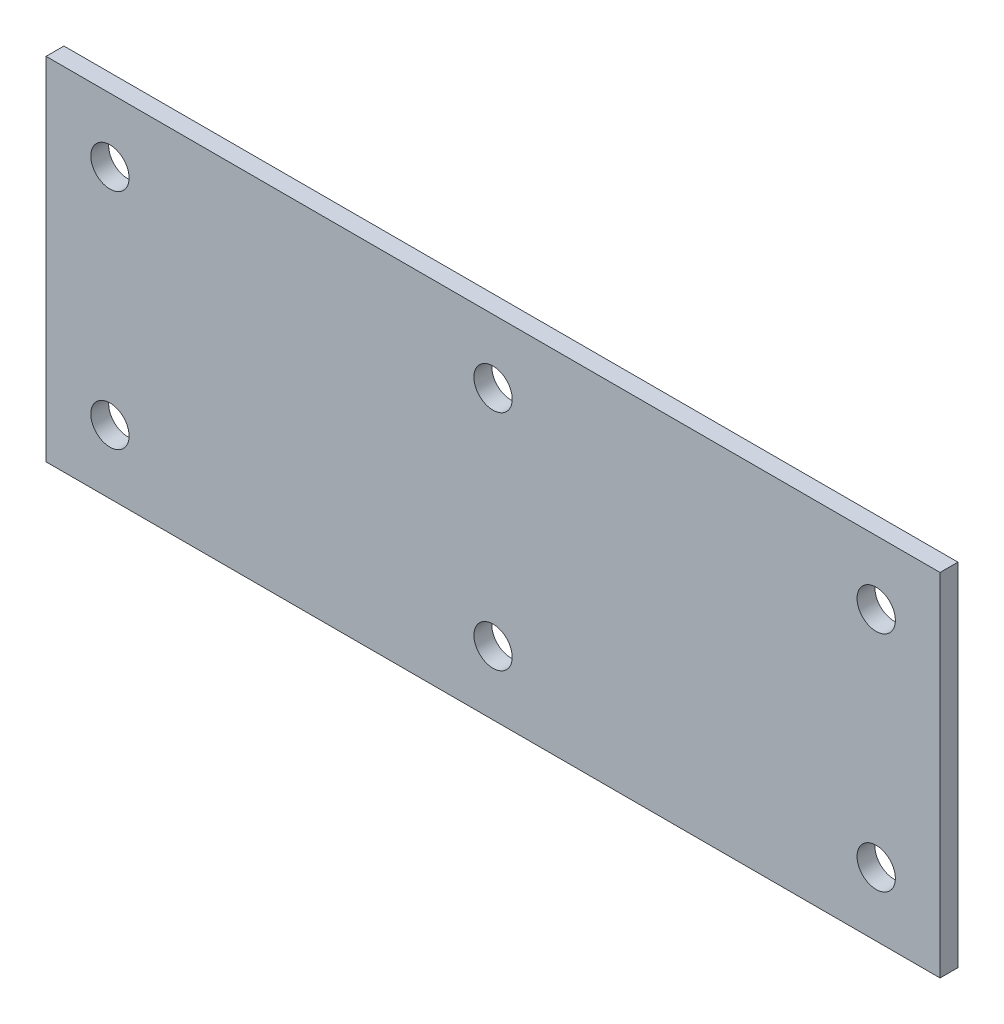
ISO-10303-21;
HEADER;
FILE_DESCRIPTION(('STEP AP214'),'2;1');
FILE_NAME('part.step','',(''),(''),'','','');
FILE_SCHEMA(('AUTOMOTIVE_DESIGN { 1 0 10303 214 1 1 1 1 }'));
ENDSEC;
DATA;
#1=APPLICATION_CONTEXT('core data for automotive mechanical design processes');
#2=APPLICATION_PROTOCOL_DEFINITION('international standard','automotive_design',2000,#1);
#3=PRODUCT_CONTEXT('',#1,'mechanical');
#4=PRODUCT('Part','Part','',(#3));
#5=PRODUCT_RELATED_PRODUCT_CATEGORY('part','',(#4));
#6=PRODUCT_DEFINITION_FORMATION('','',#4);
#7=PRODUCT_DEFINITION_CONTEXT('part definition',#1,'design');
#8=PRODUCT_DEFINITION('design','',#6,#7);
#9=PRODUCT_DEFINITION_SHAPE('','',#8);
#10=(LENGTH_UNIT() NAMED_UNIT(*) SI_UNIT(.MILLI.,.METRE.));
#11=(NAMED_UNIT(*) PLANE_ANGLE_UNIT() SI_UNIT($,.RADIAN.));
#12=(NAMED_UNIT(*) SI_UNIT($,.STERADIAN.) SOLID_ANGLE_UNIT());
#13=UNCERTAINTY_MEASURE_WITH_UNIT(LENGTH_MEASURE(1.E-05),#10,'distance_accuracy_value','');
#14=(GEOMETRIC_REPRESENTATION_CONTEXT(3) GLOBAL_UNCERTAINTY_ASSIGNED_CONTEXT((#13)) GLOBAL_UNIT_ASSIGNED_CONTEXT((#10,
#11,#12)) REPRESENTATION_CONTEXT('',''));
#15=CARTESIAN_POINT('',(0.,0.,0.));
#16=DIRECTION('',(0.,0.,1.));
#17=DIRECTION('',(1.,0.,0.));
#18=AXIS2_PLACEMENT_3D('',#15,#16,#17);
#19=CARTESIAN_POINT('',(44.45,17.4625,1.778));
#20=DIRECTION('',(-1.,0.,0.));
#21=DIRECTION('',(0.,0.,1.));
#22=AXIS2_PLACEMENT_3D('',#19,#20,#21);
#23=PLANE('',#22);
#24=DIRECTION('',(0.,1.,0.));
#25=VECTOR('',#24,1.);
#26=CARTESIAN_POINT('',(44.45,17.4625,0.));
#27=LINE('',#26,#25);
#28=CARTESIAN_POINT('',(44.45,-17.4625,0.));
#29=VERTEX_POINT('',#28);
#30=CARTESIAN_POINT('',(44.45,17.4625,0.));
#31=VERTEX_POINT('',#30);
#32=EDGE_CURVE('E113',#29,#31,#27,.T.);
#33=ORIENTED_EDGE('',*,*,#32,.T.);
#34=DIRECTION('',(0.,0.,-1.));
#35=VECTOR('',#34,1.);
#36=CARTESIAN_POINT('',(44.45,17.4625,1.778));
#37=LINE('',#36,#35);
#38=CARTESIAN_POINT('',(44.45,17.4625,1.778));
#39=VERTEX_POINT('',#38);
#40=EDGE_CURVE('E11',#39,#31,#37,.T.);
#41=ORIENTED_EDGE('',*,*,#40,.F.);
#42=DIRECTION('',(0.,1.,0.));
#43=VECTOR('',#42,1.);
#44=CARTESIAN_POINT('',(44.45,17.4625,1.778));
#45=LINE('',#44,#43);
#46=CARTESIAN_POINT('',(44.45,-17.4625,1.778));
#47=VERTEX_POINT('',#46);
#48=EDGE_CURVE('E97',#47,#39,#45,.T.);
#49=ORIENTED_EDGE('',*,*,#48,.F.);
#50=DIRECTION('',(0.,0.,-1.));
#51=VECTOR('',#50,1.);
#52=CARTESIAN_POINT('',(44.45,-17.4625,1.778));
#53=LINE('',#52,#51);
#54=EDGE_CURVE('E109',#47,#29,#53,.T.);
#55=ORIENTED_EDGE('',*,*,#54,.T.);
#56=EDGE_LOOP('',(#33,#41,#49,#55));
#57=FACE_BOUND('',#56,.T.);
#58=ADVANCED_FACE('F45',(#57),#23,.F.);
#59=CARTESIAN_POINT('',(-44.45,17.4625,1.778));
#60=DIRECTION('',(0.,-1.,0.));
#61=DIRECTION('',(0.,0.,-1.));
#62=AXIS2_PLACEMENT_3D('',#59,#60,#61);
#63=PLANE('',#62);
#64=DIRECTION('',(-1.,0.,0.));
#65=VECTOR('',#64,1.);
#66=CARTESIAN_POINT('',(-44.45,17.4625,0.));
#67=LINE('',#66,#65);
#68=CARTESIAN_POINT('',(-44.45,17.4625,0.));
#69=VERTEX_POINT('',#68);
#70=EDGE_CURVE('E102',#31,#69,#67,.T.);
#71=ORIENTED_EDGE('',*,*,#70,.T.);
#72=DIRECTION('',(0.,0.,-1.));
#73=VECTOR('',#72,1.);
#74=CARTESIAN_POINT('',(-44.45,17.4625,1.778));
#75=LINE('',#74,#73);
#76=CARTESIAN_POINT('',(-44.45,17.4625,1.778));
#77=VERTEX_POINT('',#76);
#78=EDGE_CURVE('E54',#77,#69,#75,.T.);
#79=ORIENTED_EDGE('',*,*,#78,.F.);
#80=DIRECTION('',(-1.,0.,0.));
#81=VECTOR('',#80,1.);
#82=CARTESIAN_POINT('',(-44.45,17.4625,1.778));
#83=LINE('',#82,#81);
#84=EDGE_CURVE('E92',#39,#77,#83,.T.);
#85=ORIENTED_EDGE('',*,*,#84,.F.);
#86=ORIENTED_EDGE('',*,*,#40,.T.);
#87=EDGE_LOOP('',(#71,#79,#85,#86));
#88=FACE_BOUND('',#87,.T.);
#89=ADVANCED_FACE('F101',(#88),#63,.F.);
#90=CARTESIAN_POINT('',(-44.45,17.4625,1.778));
#91=DIRECTION('',(1.,0.,0.));
#92=DIRECTION('',(0.,0.,-1.));
#93=AXIS2_PLACEMENT_3D('',#90,#91,#92);
#94=PLANE('',#93);
#95=DIRECTION('',(0.,-1.,0.));
#96=VECTOR('',#95,1.);
#97=CARTESIAN_POINT('',(-44.45,17.4625,0.));
#98=LINE('',#97,#96);
#99=CARTESIAN_POINT('',(-44.45,-17.4625,0.));
#100=VERTEX_POINT('',#99);
#101=EDGE_CURVE('E79',#69,#100,#98,.T.);
#102=ORIENTED_EDGE('',*,*,#101,.T.);
#103=DIRECTION('',(0.,0.,-1.));
#104=VECTOR('',#103,1.);
#105=CARTESIAN_POINT('',(-44.45,-17.4625,1.778));
#106=LINE('',#105,#104);
#107=CARTESIAN_POINT('',(-44.45,-17.4625,1.778));
#108=VERTEX_POINT('',#107);
#109=EDGE_CURVE('E104',#108,#100,#106,.T.);
#110=ORIENTED_EDGE('',*,*,#109,.F.);
#111=DIRECTION('',(0.,-1.,0.));
#112=VECTOR('',#111,1.);
#113=CARTESIAN_POINT('',(-44.45,17.4625,1.778));
#114=LINE('',#113,#112);
#115=EDGE_CURVE('E95',#77,#108,#114,.T.);
#116=ORIENTED_EDGE('',*,*,#115,.F.);
#117=ORIENTED_EDGE('',*,*,#78,.T.);
#118=EDGE_LOOP('',(#102,#110,#116,#117));
#119=FACE_BOUND('',#118,.T.);
#120=ADVANCED_FACE('F105',(#119),#94,.F.);
#121=CARTESIAN_POINT('',(-44.45,-17.4625,1.778));
#122=DIRECTION('',(0.,1.,0.));
#123=DIRECTION('',(0.,0.,1.));
#124=AXIS2_PLACEMENT_3D('',#121,#122,#123);
#125=PLANE('',#124);
#126=DIRECTION('',(1.,0.,0.));
#127=VECTOR('',#126,1.);
#128=CARTESIAN_POINT('',(-44.45,-17.4625,0.));
#129=LINE('',#128,#127);
#130=EDGE_CURVE('E85',#100,#29,#129,.T.);
#131=ORIENTED_EDGE('',*,*,#130,.T.);
#132=ORIENTED_EDGE('',*,*,#54,.F.);
#133=DIRECTION('',(1.,0.,0.));
#134=VECTOR('',#133,1.);
#135=CARTESIAN_POINT('',(-44.45,-17.4625,1.778));
#136=LINE('',#135,#134);
#137=EDGE_CURVE('E62',#108,#47,#136,.T.);
#138=ORIENTED_EDGE('',*,*,#137,.F.);
#139=ORIENTED_EDGE('',*,*,#109,.T.);
#140=EDGE_LOOP('',(#131,#132,#138,#139));
#141=FACE_BOUND('',#140,.T.);
#142=ADVANCED_FACE('F127',(#141),#125,.F.);
#143=CARTESIAN_POINT('',(0.,0.,1.778));
#144=DIRECTION('',(0.,0.,1.));
#145=DIRECTION('',(1.,0.,0.));
#146=AXIS2_PLACEMENT_3D('',#143,#144,#145);
#147=PLANE('',#146);
#148=CARTESIAN_POINT('',(-38.1,11.1125,1.778));
#149=DIRECTION('',(0.,0.,1.));
#150=DIRECTION('',(1.,0.,0.));
#151=AXIS2_PLACEMENT_3D('',#148,#149,#150);
#152=CIRCLE('',#151,1.905);
#153=CARTESIAN_POINT('',(-36.195,11.1125,1.778));
#154=VERTEX_POINT('',#153);
#155=EDGE_CURVE('E138',#154,#154,#152,.T.);
#156=ORIENTED_EDGE('',*,*,#155,.F.);
#157=EDGE_LOOP('',(#156));
#158=FACE_BOUND('',#157,.T.);
#159=CARTESIAN_POINT('',(-38.1,-11.1125,1.778));
#160=DIRECTION('',(0.,0.,1.));
#161=DIRECTION('',(-1.,0.,0.));
#162=AXIS2_PLACEMENT_3D('',#159,#160,#161);
#163=CIRCLE('',#162,1.905);
#164=CARTESIAN_POINT('',(-40.005,-11.1125,1.778));
#165=VERTEX_POINT('',#164);
#166=EDGE_CURVE('E163',#165,#165,#163,.T.);
#167=ORIENTED_EDGE('',*,*,#166,.F.);
#168=EDGE_LOOP('',(#167));
#169=FACE_BOUND('',#168,.T.);
#170=CARTESIAN_POINT('',(0.,-11.1125,1.778));
#171=DIRECTION('',(0.,0.,1.));
#172=DIRECTION('',(-1.,0.,0.));
#173=AXIS2_PLACEMENT_3D('',#170,#171,#172);
#174=CIRCLE('',#173,1.905);
#175=CARTESIAN_POINT('',(-1.905,-11.1125,1.778));
#176=VERTEX_POINT('',#175);
#177=EDGE_CURVE('E155',#176,#176,#174,.T.);
#178=ORIENTED_EDGE('',*,*,#177,.F.);
#179=EDGE_LOOP('',(#178));
#180=FACE_BOUND('',#179,.T.);
#181=CARTESIAN_POINT('',(38.1,-11.1125,1.778));
#182=DIRECTION('',(0.,0.,1.));
#183=DIRECTION('',(1.,0.,0.));
#184=AXIS2_PLACEMENT_3D('',#181,#182,#183);
#185=CIRCLE('',#184,1.905);
#186=CARTESIAN_POINT('',(40.005,-11.1125,1.778));
#187=VERTEX_POINT('',#186);
#188=EDGE_CURVE('E146',#187,#187,#185,.T.);
#189=ORIENTED_EDGE('',*,*,#188,.F.);
#190=EDGE_LOOP('',(#189));
#191=FACE_BOUND('',#190,.T.);
#192=CARTESIAN_POINT('',(38.1,11.1125,1.778));
#193=DIRECTION('',(0.,0.,1.));
#194=DIRECTION('',(-1.,0.,0.));
#195=AXIS2_PLACEMENT_3D('',#192,#193,#194);
#196=CIRCLE('',#195,1.905);
#197=CARTESIAN_POINT('',(36.195,11.1125,1.778));
#198=VERTEX_POINT('',#197);
#199=EDGE_CURVE('E147',#198,#198,#196,.T.);
#200=ORIENTED_EDGE('',*,*,#199,.F.);
#201=EDGE_LOOP('',(#200));
#202=FACE_BOUND('',#201,.T.);
#203=CARTESIAN_POINT('',(0.,11.1125,1.778));
#204=DIRECTION('',(0.,0.,1.));
#205=DIRECTION('',(1.,0.,0.));
#206=AXIS2_PLACEMENT_3D('',#203,#204,#205);
#207=CIRCLE('',#206,1.905);
#208=CARTESIAN_POINT('',(1.905,11.1125,1.778));
#209=VERTEX_POINT('',#208);
#210=EDGE_CURVE('E134',#209,#209,#207,.T.);
#211=ORIENTED_EDGE('',*,*,#210,.F.);
#212=EDGE_LOOP('',(#211));
#213=FACE_BOUND('',#212,.T.);
#214=ORIENTED_EDGE('',*,*,#48,.T.);
#215=ORIENTED_EDGE('',*,*,#84,.T.);
#216=ORIENTED_EDGE('',*,*,#115,.T.);
#217=ORIENTED_EDGE('',*,*,#137,.T.);
#218=EDGE_LOOP('',(#214,#215,#216,#217));
#219=FACE_BOUND('',#218,.T.);
#220=ADVANCED_FACE('F93',(#158,#169,#180,#191,#202,#213,#219),#147,.T.);
#221=CARTESIAN_POINT('',(0.,0.,0.));
#222=DIRECTION('',(0.,0.,1.));
#223=DIRECTION('',(1.,0.,0.));
#224=AXIS2_PLACEMENT_3D('',#221,#222,#223);
#225=PLANE('',#224);
#226=CARTESIAN_POINT('',(-38.1,11.1125,0.));
#227=DIRECTION('',(0.,0.,1.));
#228=DIRECTION('',(1.,0.,0.));
#229=AXIS2_PLACEMENT_3D('',#226,#227,#228);
#230=CIRCLE('',#229,1.905);
#231=CARTESIAN_POINT('',(-36.195,11.1125,0.));
#232=VERTEX_POINT('',#231);
#233=EDGE_CURVE('E167',#232,#232,#230,.T.);
#234=ORIENTED_EDGE('',*,*,#233,.T.);
#235=EDGE_LOOP('',(#234));
#236=FACE_BOUND('',#235,.T.);
#237=CARTESIAN_POINT('',(-38.1,-11.1125,0.));
#238=DIRECTION('',(0.,0.,1.));
#239=DIRECTION('',(-1.,0.,0.));
#240=AXIS2_PLACEMENT_3D('',#237,#238,#239);
#241=CIRCLE('',#240,1.905);
#242=CARTESIAN_POINT('',(-40.005,-11.1125,0.));
#243=VERTEX_POINT('',#242);
#244=EDGE_CURVE('E159',#243,#243,#241,.T.);
#245=ORIENTED_EDGE('',*,*,#244,.T.);
#246=EDGE_LOOP('',(#245));
#247=FACE_BOUND('',#246,.T.);
#248=CARTESIAN_POINT('',(0.,-11.1125,0.));
#249=DIRECTION('',(0.,0.,1.));
#250=DIRECTION('',(-1.,0.,0.));
#251=AXIS2_PLACEMENT_3D('',#248,#249,#250);
#252=CIRCLE('',#251,1.905);
#253=CARTESIAN_POINT('',(-1.905,-11.1125,0.));
#254=VERTEX_POINT('',#253);
#255=EDGE_CURVE('E151',#254,#254,#252,.T.);
#256=ORIENTED_EDGE('',*,*,#255,.T.);
#257=EDGE_LOOP('',(#256));
#258=FACE_BOUND('',#257,.T.);
#259=CARTESIAN_POINT('',(38.1,-11.1125,0.));
#260=DIRECTION('',(0.,0.,1.));
#261=DIRECTION('',(1.,0.,0.));
#262=AXIS2_PLACEMENT_3D('',#259,#260,#261);
#263=CIRCLE('',#262,1.905);
#264=CARTESIAN_POINT('',(40.005,-11.1125,0.));
#265=VERTEX_POINT('',#264);
#266=EDGE_CURVE('E142',#265,#265,#263,.T.);
#267=ORIENTED_EDGE('',*,*,#266,.T.);
#268=EDGE_LOOP('',(#267));
#269=FACE_BOUND('',#268,.T.);
#270=CARTESIAN_POINT('',(38.1,11.1125,0.));
#271=DIRECTION('',(0.,0.,1.));
#272=DIRECTION('',(-1.,0.,0.));
#273=AXIS2_PLACEMENT_3D('',#270,#271,#272);
#274=CIRCLE('',#273,1.905);
#275=CARTESIAN_POINT('',(36.195,11.1125,0.));
#276=VERTEX_POINT('',#275);
#277=EDGE_CURVE('E174',#276,#276,#274,.T.);
#278=ORIENTED_EDGE('',*,*,#277,.T.);
#279=EDGE_LOOP('',(#278));
#280=FACE_BOUND('',#279,.T.);
#281=CARTESIAN_POINT('',(0.,11.1125,0.));
#282=DIRECTION('',(0.,0.,1.));
#283=DIRECTION('',(1.,0.,0.));
#284=AXIS2_PLACEMENT_3D('',#281,#282,#283);
#285=CIRCLE('',#284,1.905);
#286=CARTESIAN_POINT('',(1.905,11.1125,0.));
#287=VERTEX_POINT('',#286);
#288=EDGE_CURVE('E117',#287,#287,#285,.T.);
#289=ORIENTED_EDGE('',*,*,#288,.T.);
#290=EDGE_LOOP('',(#289));
#291=FACE_BOUND('',#290,.T.);
#292=ORIENTED_EDGE('',*,*,#32,.F.);
#293=ORIENTED_EDGE('',*,*,#130,.F.);
#294=ORIENTED_EDGE('',*,*,#101,.F.);
#295=ORIENTED_EDGE('',*,*,#70,.F.);
#296=EDGE_LOOP('',(#292,#293,#294,#295));
#297=FACE_BOUND('',#296,.T.);
#298=ADVANCED_FACE('F130',(#236,#247,#258,#269,#280,#291,#297),#225,.F.);
#299=CARTESIAN_POINT('',(0.,11.1125,0.));
#300=DIRECTION('',(0.,0.,1.));
#301=DIRECTION('',(1.,0.,0.));
#302=AXIS2_PLACEMENT_3D('',#299,#300,#301);
#303=CYLINDRICAL_SURFACE('',#302,1.905);
#304=ORIENTED_EDGE('',*,*,#288,.F.);
#305=EDGE_LOOP('',(#304));
#306=FACE_BOUND('',#305,.T.);
#307=ORIENTED_EDGE('',*,*,#210,.T.);
#308=EDGE_LOOP('',(#307));
#309=FACE_BOUND('',#308,.T.);
#310=ADVANCED_FACE('F190',(#306,#309),#303,.F.);
#311=CARTESIAN_POINT('',(38.1,11.1125,0.));
#312=DIRECTION('',(0.,0.,1.));
#313=DIRECTION('',(1.,0.,0.));
#314=AXIS2_PLACEMENT_3D('',#311,#312,#313);
#315=CYLINDRICAL_SURFACE('',#314,1.905);
#316=ORIENTED_EDGE('',*,*,#277,.F.);
#317=EDGE_LOOP('',(#316));
#318=FACE_BOUND('',#317,.T.);
#319=ORIENTED_EDGE('',*,*,#199,.T.);
#320=EDGE_LOOP('',(#319));
#321=FACE_BOUND('',#320,.T.);
#322=ADVANCED_FACE('F182',(#318,#321),#315,.F.);
#323=CARTESIAN_POINT('',(38.1,-11.1125,0.));
#324=DIRECTION('',(0.,0.,1.));
#325=DIRECTION('',(1.,0.,0.));
#326=AXIS2_PLACEMENT_3D('',#323,#324,#325);
#327=CYLINDRICAL_SURFACE('',#326,1.905);
#328=ORIENTED_EDGE('',*,*,#266,.F.);
#329=EDGE_LOOP('',(#328));
#330=FACE_BOUND('',#329,.T.);
#331=ORIENTED_EDGE('',*,*,#188,.T.);
#332=EDGE_LOOP('',(#331));
#333=FACE_BOUND('',#332,.T.);
#334=ADVANCED_FACE('F198',(#330,#333),#327,.F.);
#335=CARTESIAN_POINT('',(0.,-11.1125,0.));
#336=DIRECTION('',(0.,0.,1.));
#337=DIRECTION('',(1.,0.,0.));
#338=AXIS2_PLACEMENT_3D('',#335,#336,#337);
#339=CYLINDRICAL_SURFACE('',#338,1.905);
#340=ORIENTED_EDGE('',*,*,#255,.F.);
#341=EDGE_LOOP('',(#340));
#342=FACE_BOUND('',#341,.T.);
#343=ORIENTED_EDGE('',*,*,#177,.T.);
#344=EDGE_LOOP('',(#343));
#345=FACE_BOUND('',#344,.T.);
#346=ADVANCED_FACE('F249',(#342,#345),#339,.F.);
#347=CARTESIAN_POINT('',(-38.1,-11.1125,0.));
#348=DIRECTION('',(0.,0.,1.));
#349=DIRECTION('',(1.,0.,0.));
#350=AXIS2_PLACEMENT_3D('',#347,#348,#349);
#351=CYLINDRICAL_SURFACE('',#350,1.905);
#352=ORIENTED_EDGE('',*,*,#244,.F.);
#353=EDGE_LOOP('',(#352));
#354=FACE_BOUND('',#353,.T.);
#355=ORIENTED_EDGE('',*,*,#166,.T.);
#356=EDGE_LOOP('',(#355));
#357=FACE_BOUND('',#356,.T.);
#358=ADVANCED_FACE('F258',(#354,#357),#351,.F.);
#359=CARTESIAN_POINT('',(-38.1,11.1125,0.));
#360=DIRECTION('',(0.,0.,1.));
#361=DIRECTION('',(1.,0.,0.));
#362=AXIS2_PLACEMENT_3D('',#359,#360,#361);
#363=CYLINDRICAL_SURFACE('',#362,1.905);
#364=ORIENTED_EDGE('',*,*,#233,.F.);
#365=EDGE_LOOP('',(#364));
#366=FACE_BOUND('',#365,.T.);
#367=ORIENTED_EDGE('',*,*,#155,.T.);
#368=EDGE_LOOP('',(#367));
#369=FACE_BOUND('',#368,.T.);
#370=ADVANCED_FACE('F268',(#366,#369),#363,.F.);
#371=CLOSED_SHELL('',(#58,#89,#120,#142,#220,#298,#310,#322,#334,#346,#358,#370));
#372=MANIFOLD_SOLID_BREP('B2',#371);
#373=ADVANCED_BREP_SHAPE_REPRESENTATION('',(#18,#372),#14);
#374=SHAPE_DEFINITION_REPRESENTATION(#9,#373);
ENDSEC;
END-ISO-10303-21;
